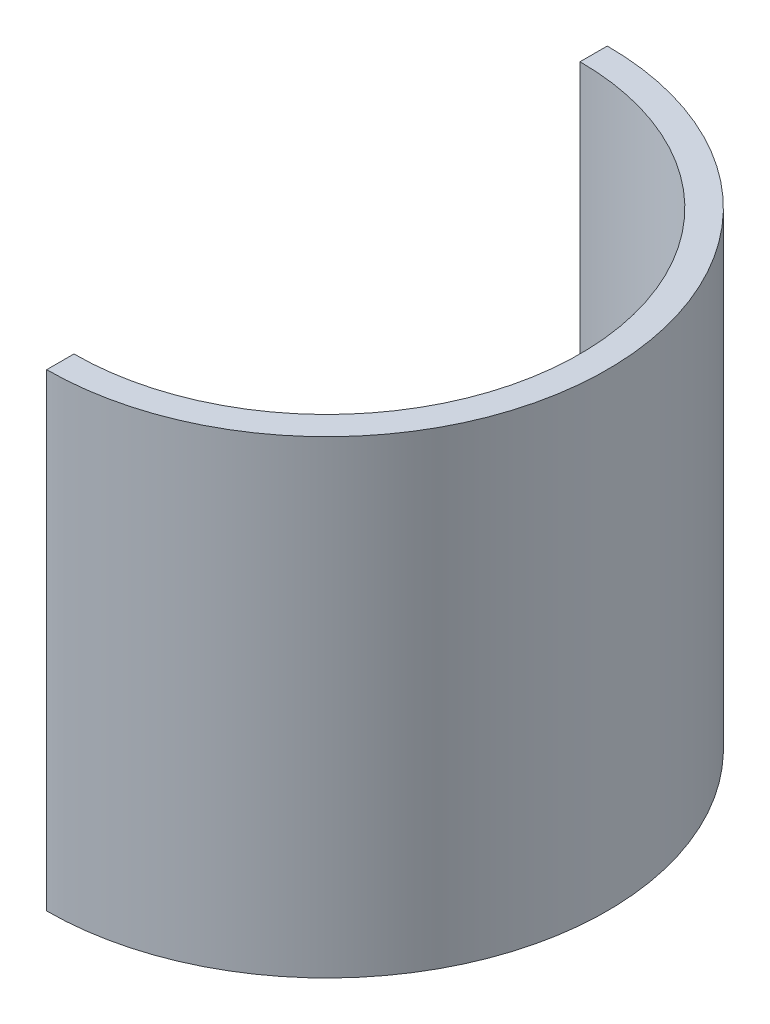
ISO-10303-21;
HEADER;
FILE_DESCRIPTION(('STEP AP214'),'2;1');
FILE_NAME('part.step','',(''),(''),'','','');
FILE_SCHEMA(('AUTOMOTIVE_DESIGN { 1 0 10303 214 1 1 1 1 }'));
ENDSEC;
DATA;
#1=APPLICATION_CONTEXT('core data for automotive mechanical design processes');
#2=APPLICATION_PROTOCOL_DEFINITION('international standard','automotive_design',2000,#1);
#3=PRODUCT_CONTEXT('',#1,'mechanical');
#4=PRODUCT('Part','Part','',(#3));
#5=PRODUCT_RELATED_PRODUCT_CATEGORY('part','',(#4));
#6=PRODUCT_DEFINITION_FORMATION('','',#4);
#7=PRODUCT_DEFINITION_CONTEXT('part definition',#1,'design');
#8=PRODUCT_DEFINITION('design','',#6,#7);
#9=PRODUCT_DEFINITION_SHAPE('','',#8);
#10=(LENGTH_UNIT() NAMED_UNIT(*) SI_UNIT(.MILLI.,.METRE.));
#11=(NAMED_UNIT(*) PLANE_ANGLE_UNIT() SI_UNIT($,.RADIAN.));
#12=(NAMED_UNIT(*) SI_UNIT($,.STERADIAN.) SOLID_ANGLE_UNIT());
#13=UNCERTAINTY_MEASURE_WITH_UNIT(LENGTH_MEASURE(1.E-05),#10,'distance_accuracy_value','');
#14=(GEOMETRIC_REPRESENTATION_CONTEXT(3) GLOBAL_UNCERTAINTY_ASSIGNED_CONTEXT((#13)) GLOBAL_UNIT_ASSIGNED_CONTEXT((#10,
#11,#12)) REPRESENTATION_CONTEXT('',''));
#15=CARTESIAN_POINT('',(0.,0.,0.));
#16=DIRECTION('',(0.,0.,1.));
#17=DIRECTION('',(1.,0.,0.));
#18=AXIS2_PLACEMENT_3D('',#15,#16,#17);
#19=CARTESIAN_POINT('',(0.,0.,74.5287219574057));
#20=DIRECTION('',(-1.,0.,0.));
#21=DIRECTION('',(0.,0.,1.));
#22=AXIS2_PLACEMENT_3D('',#19,#20,#21);
#23=PLANE('',#22);
#24=DIRECTION('',(0.,-1.,0.));
#25=VECTOR('',#24,1.);
#26=CARTESIAN_POINT('',(0.,43.487561786586,83.6893609787028));
#27=LINE('',#26,#25);
#28=CARTESIAN_POINT('',(0.,43.487561786586,83.6893609787028));
#29=VERTEX_POINT('',#28);
#30=CARTESIAN_POINT('',(0.,-42.512438213414,83.6893609787029));
#31=VERTEX_POINT('',#30);
#32=EDGE_CURVE('E92',#29,#31,#27,.T.);
#33=ORIENTED_EDGE('',*,*,#32,.T.);
#34=DIRECTION('',(0.,0.,1.));
#35=VECTOR('',#34,1.);
#36=CARTESIAN_POINT('',(0.,-42.512438213414,83.6893609787029));
#37=LINE('',#36,#35);
#38=CARTESIAN_POINT('',(0.,-42.512438213414,88.6893609787029));
#39=VERTEX_POINT('',#38);
#40=EDGE_CURVE('E85',#31,#39,#37,.T.);
#41=ORIENTED_EDGE('',*,*,#40,.T.);
#42=DIRECTION('',(0.,1.,0.));
#43=VECTOR('',#42,1.);
#44=CARTESIAN_POINT('',(0.,43.487561786586,88.6893609787028));
#45=LINE('',#44,#43);
#46=CARTESIAN_POINT('',(0.,43.487561786586,88.6893609787028));
#47=VERTEX_POINT('',#46);
#48=EDGE_CURVE('E80',#39,#47,#45,.T.);
#49=ORIENTED_EDGE('',*,*,#48,.T.);
#50=DIRECTION('',(0.,0.,-1.));
#51=VECTOR('',#50,1.);
#52=CARTESIAN_POINT('',(0.,43.487561786586,83.6893609787028));
#53=LINE('',#52,#51);
#54=EDGE_CURVE('E75',#47,#29,#53,.T.);
#55=ORIENTED_EDGE('',*,*,#54,.T.);
#56=EDGE_LOOP('',(#33,#41,#49,#55));
#57=FACE_BOUND('',#56,.T.);
#58=ADVANCED_FACE('F39',(#57),#23,.T.);
#59=CARTESIAN_POINT('',(0.,0.,0.));
#60=DIRECTION('',(1.,0.,0.));
#61=DIRECTION('',(0.,0.,-1.));
#62=AXIS2_PLACEMENT_3D('',#59,#60,#61);
#63=PLANE('',#62);
#64=DIRECTION('',(0.,-1.,0.));
#65=VECTOR('',#64,1.);
#66=CARTESIAN_POINT('',(0.,43.487561786586,-9.16063902129713));
#67=LINE('',#66,#65);
#68=CARTESIAN_POINT('',(0.,43.487561786586,-9.16063902129713));
#69=VERTEX_POINT('',#68);
#70=CARTESIAN_POINT('',(0.,-42.512438213414,-9.16063902129714));
#71=VERTEX_POINT('',#70);
#72=EDGE_CURVE('E103',#69,#71,#67,.T.);
#73=ORIENTED_EDGE('',*,*,#72,.F.);
#74=DIRECTION('',(0.,0.,1.));
#75=VECTOR('',#74,1.);
#76=CARTESIAN_POINT('',(0.,43.487561786586,-9.16063902129713));
#77=LINE('',#76,#75);
#78=CARTESIAN_POINT('',(0.,43.487561786586,-14.1606390212971));
#79=VERTEX_POINT('',#78);
#80=EDGE_CURVE('E11',#79,#69,#77,.T.);
#81=ORIENTED_EDGE('',*,*,#80,.F.);
#82=DIRECTION('',(0.,1.,0.));
#83=VECTOR('',#82,1.);
#84=CARTESIAN_POINT('',(0.,43.487561786586,-14.1606390212971));
#85=LINE('',#84,#83);
#86=CARTESIAN_POINT('',(0.,-42.512438213414,-14.1606390212971));
#87=VERTEX_POINT('',#86);
#88=EDGE_CURVE('E54',#87,#79,#85,.T.);
#89=ORIENTED_EDGE('',*,*,#88,.F.);
#90=DIRECTION('',(0.,0.,-1.));
#91=VECTOR('',#90,1.);
#92=CARTESIAN_POINT('',(0.,-42.512438213414,-9.16063902129714));
#93=LINE('',#92,#91);
#94=EDGE_CURVE('E63',#71,#87,#93,.T.);
#95=ORIENTED_EDGE('',*,*,#94,.F.);
#96=EDGE_LOOP('',(#73,#81,#89,#95));
#97=FACE_BOUND('',#96,.T.);
#98=ADVANCED_FACE('F132',(#97),#63,.F.);
#99=CARTESIAN_POINT('',(0.,0.,37.2643609787029));
#100=DIRECTION('',(0.,1.,0.));
#101=DIRECTION('',(0.,0.,1.));
#102=AXIS2_PLACEMENT_3D('',#99,#100,#101);
#103=CYLINDRICAL_SURFACE('',#102,46.425);
#104=CARTESIAN_POINT('',(0.,-42.512438213414,37.2643609787029));
#105=DIRECTION('',(0.,1.,0.));
#106=DIRECTION('',(0.,0.,1.));
#107=AXIS2_PLACEMENT_3D('',#104,#105,#106);
#108=CIRCLE('',#107,46.425);
#109=EDGE_CURVE('E95',#31,#71,#108,.T.);
#110=ORIENTED_EDGE('',*,*,#109,.F.);
#111=ORIENTED_EDGE('',*,*,#32,.F.);
#112=CARTESIAN_POINT('',(0.,43.487561786586,37.2643609787029));
#113=DIRECTION('',(0.,1.,0.));
#114=DIRECTION('',(0.,0.,1.));
#115=AXIS2_PLACEMENT_3D('',#112,#113,#114);
#116=CIRCLE('',#115,46.425);
#117=EDGE_CURVE('E94',#29,#69,#116,.T.);
#118=ORIENTED_EDGE('',*,*,#117,.T.);
#119=ORIENTED_EDGE('',*,*,#72,.T.);
#120=EDGE_LOOP('',(#110,#111,#118,#119));
#121=FACE_BOUND('',#120,.T.);
#122=ADVANCED_FACE('F93',(#121),#103,.F.);
#123=CARTESIAN_POINT('',(0.,-42.512438213414,83.6893609787029));
#124=DIRECTION('',(0.,1.,0.));
#125=DIRECTION('',(0.,0.,1.));
#126=AXIS2_PLACEMENT_3D('',#123,#124,#125);
#127=PLANE('',#126);
#128=CARTESIAN_POINT('',(0.,-42.512438213414,37.2643609787029));
#129=DIRECTION('',(0.,1.,0.));
#130=DIRECTION('',(0.,0.,1.));
#131=AXIS2_PLACEMENT_3D('',#128,#129,#130);
#132=CIRCLE('',#131,51.425);
#133=EDGE_CURVE('E113',#39,#87,#132,.T.);
#134=ORIENTED_EDGE('',*,*,#133,.F.);
#135=ORIENTED_EDGE('',*,*,#40,.F.);
#136=ORIENTED_EDGE('',*,*,#109,.T.);
#137=ORIENTED_EDGE('',*,*,#94,.T.);
#138=EDGE_LOOP('',(#134,#135,#136,#137));
#139=FACE_BOUND('',#138,.T.);
#140=ADVANCED_FACE('F123',(#139),#127,.F.);
#141=CARTESIAN_POINT('',(0.,0.,37.2643609787029));
#142=DIRECTION('',(0.,1.,0.));
#143=DIRECTION('',(0.,0.,1.));
#144=AXIS2_PLACEMENT_3D('',#141,#142,#143);
#145=CYLINDRICAL_SURFACE('',#144,51.425);
#146=CARTESIAN_POINT('',(0.,43.487561786586,37.2643609787029));
#147=DIRECTION('',(0.,1.,0.));
#148=DIRECTION('',(0.,0.,1.));
#149=AXIS2_PLACEMENT_3D('',#146,#147,#148);
#150=CIRCLE('',#149,51.425);
#151=EDGE_CURVE('E47',#47,#79,#150,.T.);
#152=ORIENTED_EDGE('',*,*,#151,.F.);
#153=ORIENTED_EDGE('',*,*,#48,.F.);
#154=ORIENTED_EDGE('',*,*,#133,.T.);
#155=ORIENTED_EDGE('',*,*,#88,.T.);
#156=EDGE_LOOP('',(#152,#153,#154,#155));
#157=FACE_BOUND('',#156,.T.);
#158=ADVANCED_FACE('F121',(#157),#145,.T.);
#159=CARTESIAN_POINT('',(0.,43.487561786586,83.6893609787028));
#160=DIRECTION('',(0.,-1.,0.));
#161=DIRECTION('',(0.,0.,-1.));
#162=AXIS2_PLACEMENT_3D('',#159,#160,#161);
#163=PLANE('',#162);
#164=ORIENTED_EDGE('',*,*,#80,.T.);
#165=ORIENTED_EDGE('',*,*,#117,.F.);
#166=ORIENTED_EDGE('',*,*,#54,.F.);
#167=ORIENTED_EDGE('',*,*,#151,.T.);
#168=EDGE_LOOP('',(#164,#165,#166,#167));
#169=FACE_BOUND('',#168,.T.);
#170=ADVANCED_FACE('F100',(#169),#163,.F.);
#171=CLOSED_SHELL('',(#58,#98,#122,#140,#158,#170));
#172=MANIFOLD_SOLID_BREP('B2',#171);
#173=ADVANCED_BREP_SHAPE_REPRESENTATION('',(#18,#172),#14);
#174=SHAPE_DEFINITION_REPRESENTATION(#9,#173);
ENDSEC;
END-ISO-10303-21;
